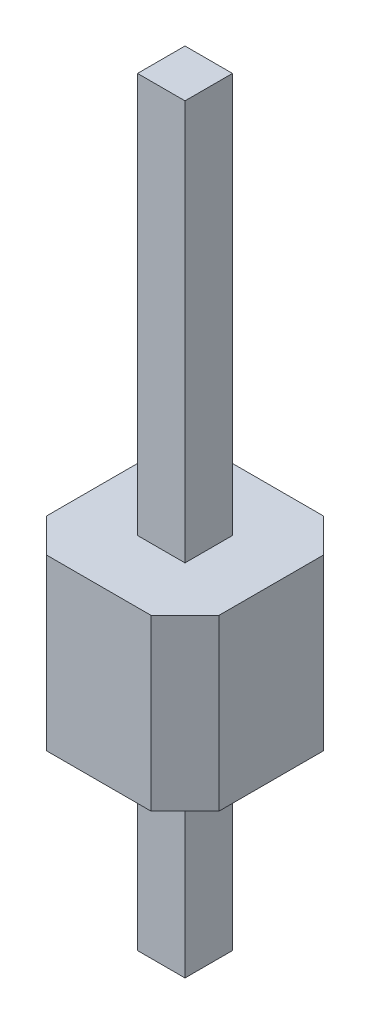
ISO-10303-21;
HEADER;
FILE_DESCRIPTION(('STEP AP214'),'2;1');
FILE_NAME('part.step','',(''),(''),'','','');
FILE_SCHEMA(('AUTOMOTIVE_DESIGN { 1 0 10303 214 1 1 1 1 }'));
ENDSEC;
DATA;
#1=APPLICATION_CONTEXT('core data for automotive mechanical design processes');
#2=APPLICATION_PROTOCOL_DEFINITION('international standard','automotive_design',2000,#1);
#3=PRODUCT_CONTEXT('',#1,'mechanical');
#4=PRODUCT('Part','Part','',(#3));
#5=PRODUCT_RELATED_PRODUCT_CATEGORY('part','',(#4));
#6=PRODUCT_DEFINITION_FORMATION('','',#4);
#7=PRODUCT_DEFINITION_CONTEXT('part definition',#1,'design');
#8=PRODUCT_DEFINITION('design','',#6,#7);
#9=PRODUCT_DEFINITION_SHAPE('','',#8);
#10=(LENGTH_UNIT() NAMED_UNIT(*) SI_UNIT(.MILLI.,.METRE.));
#11=(NAMED_UNIT(*) PLANE_ANGLE_UNIT() SI_UNIT($,.RADIAN.));
#12=(NAMED_UNIT(*) SI_UNIT($,.STERADIAN.) SOLID_ANGLE_UNIT());
#13=UNCERTAINTY_MEASURE_WITH_UNIT(LENGTH_MEASURE(1.E-05),#10,'distance_accuracy_value','');
#14=(GEOMETRIC_REPRESENTATION_CONTEXT(3) GLOBAL_UNCERTAINTY_ASSIGNED_CONTEXT((#13)) GLOBAL_UNIT_ASSIGNED_CONTEXT((#10,
#11,#12)) REPRESENTATION_CONTEXT('',''));
#15=CARTESIAN_POINT('',(0.,0.,0.));
#16=DIRECTION('',(0.,0.,1.));
#17=DIRECTION('',(1.,0.,0.));
#18=AXIS2_PLACEMENT_3D('',#15,#16,#17);
#19=CARTESIAN_POINT('',(1.62,11.2,0.));
#20=DIRECTION('',(1.,0.,0.));
#21=DIRECTION('',(0.,0.,-1.));
#22=AXIS2_PLACEMENT_3D('',#19,#20,#21);
#23=PLANE('',#22);
#24=DIRECTION('',(0.,0.,1.));
#25=VECTOR('',#24,1.);
#26=CARTESIAN_POINT('',(1.62,5.3,0.));
#27=LINE('',#26,#25);
#28=CARTESIAN_POINT('',(1.62,5.3,-1.62));
#29=VERTEX_POINT('',#28);
#30=CARTESIAN_POINT('',(1.62,5.3,-0.92));
#31=VERTEX_POINT('',#30);
#32=EDGE_CURVE('E160',#29,#31,#27,.T.);
#33=ORIENTED_EDGE('',*,*,#32,.F.);
#34=DIRECTION('',(0.,-1.,0.));
#35=VECTOR('',#34,1.);
#36=CARTESIAN_POINT('',(1.62,11.2,-1.62));
#37=LINE('',#36,#35);
#38=CARTESIAN_POINT('',(1.62,11.2,-1.62));
#39=VERTEX_POINT('',#38);
#40=EDGE_CURVE('E173',#39,#29,#37,.T.);
#41=ORIENTED_EDGE('',*,*,#40,.F.);
#42=DIRECTION('',(0.,0.,1.));
#43=VECTOR('',#42,1.);
#44=CARTESIAN_POINT('',(1.62,11.2,0.));
#45=LINE('',#44,#43);
#46=CARTESIAN_POINT('',(1.62,11.2,-0.92));
#47=VERTEX_POINT('',#46);
#48=EDGE_CURVE('E286',#39,#47,#45,.T.);
#49=ORIENTED_EDGE('',*,*,#48,.T.);
#50=DIRECTION('',(0.,-1.,0.));
#51=VECTOR('',#50,1.);
#52=CARTESIAN_POINT('',(1.62,11.2,-0.92));
#53=LINE('',#52,#51);
#54=EDGE_CURVE('E176',#47,#31,#53,.T.);
#55=ORIENTED_EDGE('',*,*,#54,.T.);
#56=EDGE_LOOP('',(#33,#41,#49,#55));
#57=FACE_BOUND('',#56,.T.);
#58=ADVANCED_FACE('F41',(#57),#23,.T.);
#59=CARTESIAN_POINT('',(0.,11.2,-1.62));
#60=DIRECTION('',(0.,0.,-1.));
#61=DIRECTION('',(-1.,0.,0.));
#62=AXIS2_PLACEMENT_3D('',#59,#60,#61);
#63=PLANE('',#62);
#64=DIRECTION('',(1.,0.,0.));
#65=VECTOR('',#64,1.);
#66=CARTESIAN_POINT('',(0.,5.3,-1.62));
#67=LINE('',#66,#65);
#68=CARTESIAN_POINT('',(0.919999999999999,5.3,-1.62));
#69=VERTEX_POINT('',#68);
#70=EDGE_CURVE('E157',#69,#29,#67,.T.);
#71=ORIENTED_EDGE('',*,*,#70,.F.);
#72=DIRECTION('',(0.,-1.,0.));
#73=VECTOR('',#72,1.);
#74=CARTESIAN_POINT('',(0.919999999999999,11.2,-1.62));
#75=LINE('',#74,#73);
#76=CARTESIAN_POINT('',(0.919999999999999,11.2,-1.62));
#77=VERTEX_POINT('',#76);
#78=EDGE_CURVE('E192',#77,#69,#75,.T.);
#79=ORIENTED_EDGE('',*,*,#78,.F.);
#80=DIRECTION('',(1.,0.,0.));
#81=VECTOR('',#80,1.);
#82=CARTESIAN_POINT('',(0.,11.2,-1.62));
#83=LINE('',#82,#81);
#84=EDGE_CURVE('E183',#77,#39,#83,.T.);
#85=ORIENTED_EDGE('',*,*,#84,.T.);
#86=ORIENTED_EDGE('',*,*,#40,.T.);
#87=EDGE_LOOP('',(#71,#79,#85,#86));
#88=FACE_BOUND('',#87,.T.);
#89=ADVANCED_FACE('F181',(#88),#63,.T.);
#90=CARTESIAN_POINT('',(0.92,11.2,0.));
#91=DIRECTION('',(1.,0.,0.));
#92=DIRECTION('',(0.,0.,-1.));
#93=AXIS2_PLACEMENT_3D('',#90,#91,#92);
#94=PLANE('',#93);
#95=ORIENTED_EDGE('',*,*,#78,.T.);
#96=DIRECTION('',(0.,0.,1.));
#97=VECTOR('',#96,1.);
#98=CARTESIAN_POINT('',(0.92,5.3,0.));
#99=LINE('',#98,#97);
#100=CARTESIAN_POINT('',(0.92,5.3,-0.92));
#101=VERTEX_POINT('',#100);
#102=EDGE_CURVE('E163',#69,#101,#99,.T.);
#103=ORIENTED_EDGE('',*,*,#102,.T.);
#104=DIRECTION('',(0.,-1.,0.));
#105=VECTOR('',#104,1.);
#106=CARTESIAN_POINT('',(0.92,11.2,-0.92));
#107=LINE('',#106,#105);
#108=CARTESIAN_POINT('',(0.92,11.2,-0.92));
#109=VERTEX_POINT('',#108);
#110=EDGE_CURVE('E316',#109,#101,#107,.T.);
#111=ORIENTED_EDGE('',*,*,#110,.F.);
#112=DIRECTION('',(0.,0.,1.));
#113=VECTOR('',#112,1.);
#114=CARTESIAN_POINT('',(0.92,11.2,0.));
#115=LINE('',#114,#113);
#116=EDGE_CURVE('E292',#77,#109,#115,.T.);
#117=ORIENTED_EDGE('',*,*,#116,.F.);
#118=EDGE_LOOP('',(#95,#103,#111,#117));
#119=FACE_BOUND('',#118,.T.);
#120=ADVANCED_FACE('F377',(#119),#94,.F.);
#121=CARTESIAN_POINT('',(0.,11.2,-0.92));
#122=DIRECTION('',(0.,0.,-1.));
#123=DIRECTION('',(-1.,0.,0.));
#124=AXIS2_PLACEMENT_3D('',#121,#122,#123);
#125=PLANE('',#124);
#126=ORIENTED_EDGE('',*,*,#110,.T.);
#127=DIRECTION('',(1.,0.,0.));
#128=VECTOR('',#127,1.);
#129=CARTESIAN_POINT('',(0.,5.3,-0.92));
#130=LINE('',#129,#128);
#131=EDGE_CURVE('E178',#101,#31,#130,.T.);
#132=ORIENTED_EDGE('',*,*,#131,.T.);
#133=ORIENTED_EDGE('',*,*,#54,.F.);
#134=DIRECTION('',(1.,0.,0.));
#135=VECTOR('',#134,1.);
#136=CARTESIAN_POINT('',(0.,11.2,-0.92));
#137=LINE('',#136,#135);
#138=EDGE_CURVE('E295',#109,#47,#137,.T.);
#139=ORIENTED_EDGE('',*,*,#138,.F.);
#140=EDGE_LOOP('',(#126,#132,#133,#139));
#141=FACE_BOUND('',#140,.T.);
#142=ADVANCED_FACE('F394',(#141),#125,.F.);
#143=CARTESIAN_POINT('',(0.,11.2,0.));
#144=DIRECTION('',(0.,1.,0.));
#145=DIRECTION('',(0.,0.,1.));
#146=AXIS2_PLACEMENT_3D('',#143,#144,#145);
#147=PLANE('',#146);
#148=ORIENTED_EDGE('',*,*,#48,.F.);
#149=ORIENTED_EDGE('',*,*,#84,.F.);
#150=ORIENTED_EDGE('',*,*,#116,.T.);
#151=ORIENTED_EDGE('',*,*,#138,.T.);
#152=EDGE_LOOP('',(#148,#149,#150,#151));
#153=FACE_BOUND('',#152,.T.);
#154=ADVANCED_FACE('F398',(#153),#147,.T.);
#155=CARTESIAN_POINT('',(0.,5.3,0.));
#156=DIRECTION('',(0.,0.,-1.));
#157=DIRECTION('',(-1.,0.,0.));
#158=AXIS2_PLACEMENT_3D('',#155,#156,#157);
#159=PLANE('',#158);
#160=DIRECTION('',(1.,0.,0.));
#161=VECTOR('',#160,1.);
#162=CARTESIAN_POINT('',(0.,5.3,0.));
#163=LINE('',#162,#161);
#164=CARTESIAN_POINT('',(0.499999999999999,5.3,0.));
#165=VERTEX_POINT('',#164);
#166=CARTESIAN_POINT('',(2.04,5.3,0.));
#167=VERTEX_POINT('',#166);
#168=EDGE_CURVE('E250',#165,#167,#163,.T.);
#169=ORIENTED_EDGE('',*,*,#168,.F.);
#170=DIRECTION('',(0.,-1.,0.));
#171=VECTOR('',#170,1.);
#172=CARTESIAN_POINT('',(0.499999999999999,2.8,0.));
#173=LINE('',#172,#171);
#174=CARTESIAN_POINT('',(0.499999999999999,2.8,0.));
#175=VERTEX_POINT('',#174);
#176=EDGE_CURVE('E190',#165,#175,#173,.T.);
#177=ORIENTED_EDGE('',*,*,#176,.T.);
#178=DIRECTION('',(1.,0.,0.));
#179=VECTOR('',#178,1.);
#180=CARTESIAN_POINT('',(0.,2.8,0.));
#181=LINE('',#180,#179);
#182=CARTESIAN_POINT('',(2.04,2.8,0.));
#183=VERTEX_POINT('',#182);
#184=EDGE_CURVE('E268',#175,#183,#181,.T.);
#185=ORIENTED_EDGE('',*,*,#184,.T.);
#186=DIRECTION('',(0.,1.,0.));
#187=VECTOR('',#186,1.);
#188=CARTESIAN_POINT('',(2.04,5.3,0.));
#189=LINE('',#188,#187);
#190=EDGE_CURVE('E185',#183,#167,#189,.T.);
#191=ORIENTED_EDGE('',*,*,#190,.T.);
#192=EDGE_LOOP('',(#169,#177,#185,#191));
#193=FACE_BOUND('',#192,.T.);
#194=ADVANCED_FACE('F358',(#193),#159,.F.);
#195=CARTESIAN_POINT('',(2.54,5.3,0.));
#196=DIRECTION('',(-1.,0.,0.));
#197=DIRECTION('',(0.,0.,1.));
#198=AXIS2_PLACEMENT_3D('',#195,#196,#197);
#199=PLANE('',#198);
#200=DIRECTION('',(0.,0.,-1.));
#201=VECTOR('',#200,1.);
#202=CARTESIAN_POINT('',(2.54,5.3,0.));
#203=LINE('',#202,#201);
#204=CARTESIAN_POINT('',(2.54,5.3,-0.499999999999999));
#205=VERTEX_POINT('',#204);
#206=CARTESIAN_POINT('',(2.54,5.3,-2.04));
#207=VERTEX_POINT('',#206);
#208=EDGE_CURVE('E240',#205,#207,#203,.T.);
#209=ORIENTED_EDGE('',*,*,#208,.F.);
#210=DIRECTION('',(0.,-1.,0.));
#211=VECTOR('',#210,1.);
#212=CARTESIAN_POINT('',(2.54,5.3,-0.499999999999999));
#213=LINE('',#212,#211);
#214=CARTESIAN_POINT('',(2.54,2.8,-0.499999999999999));
#215=VERTEX_POINT('',#214);
#216=EDGE_CURVE('E11',#205,#215,#213,.T.);
#217=ORIENTED_EDGE('',*,*,#216,.T.);
#218=DIRECTION('',(0.,0.,-1.));
#219=VECTOR('',#218,1.);
#220=CARTESIAN_POINT('',(2.54,2.8,0.));
#221=LINE('',#220,#219);
#222=CARTESIAN_POINT('',(2.54,2.8,-2.04));
#223=VERTEX_POINT('',#222);
#224=EDGE_CURVE('E243',#215,#223,#221,.T.);
#225=ORIENTED_EDGE('',*,*,#224,.T.);
#226=DIRECTION('',(0.,1.,0.));
#227=VECTOR('',#226,1.);
#228=CARTESIAN_POINT('',(2.54,5.3,-2.04));
#229=LINE('',#228,#227);
#230=EDGE_CURVE('E51',#223,#207,#229,.T.);
#231=ORIENTED_EDGE('',*,*,#230,.T.);
#232=EDGE_LOOP('',(#209,#217,#225,#231));
#233=FACE_BOUND('',#232,.T.);
#234=ADVANCED_FACE('F239',(#233),#199,.F.);
#235=CARTESIAN_POINT('',(0.,5.3,-2.54));
#236=DIRECTION('',(0.,0.,-1.));
#237=DIRECTION('',(-1.,0.,0.));
#238=AXIS2_PLACEMENT_3D('',#235,#236,#237);
#239=PLANE('',#238);
#240=DIRECTION('',(1.,0.,0.));
#241=VECTOR('',#240,1.);
#242=CARTESIAN_POINT('',(0.,2.8,-2.54));
#243=LINE('',#242,#241);
#244=CARTESIAN_POINT('',(0.5,2.8,-2.54));
#245=VERTEX_POINT('',#244);
#246=CARTESIAN_POINT('',(2.04,2.8,-2.54));
#247=VERTEX_POINT('',#246);
#248=EDGE_CURVE('E255',#245,#247,#243,.T.);
#249=ORIENTED_EDGE('',*,*,#248,.F.);
#250=DIRECTION('',(0.,1.,0.));
#251=VECTOR('',#250,1.);
#252=CARTESIAN_POINT('',(0.5,5.3,-2.54));
#253=LINE('',#252,#251);
#254=CARTESIAN_POINT('',(0.5,5.3,-2.54));
#255=VERTEX_POINT('',#254);
#256=EDGE_CURVE('E65',#245,#255,#253,.T.);
#257=ORIENTED_EDGE('',*,*,#256,.T.);
#258=DIRECTION('',(1.,0.,0.));
#259=VECTOR('',#258,1.);
#260=CARTESIAN_POINT('',(0.,5.3,-2.54));
#261=LINE('',#260,#259);
#262=CARTESIAN_POINT('',(2.04,5.3,-2.54));
#263=VERTEX_POINT('',#262);
#264=EDGE_CURVE('E249',#255,#263,#261,.T.);
#265=ORIENTED_EDGE('',*,*,#264,.T.);
#266=DIRECTION('',(0.,-1.,0.));
#267=VECTOR('',#266,1.);
#268=CARTESIAN_POINT('',(2.04,2.8,-2.54));
#269=LINE('',#268,#267);
#270=EDGE_CURVE('E229',#263,#247,#269,.T.);
#271=ORIENTED_EDGE('',*,*,#270,.T.);
#272=EDGE_LOOP('',(#249,#257,#265,#271));
#273=FACE_BOUND('',#272,.T.);
#274=ADVANCED_FACE('F254',(#273),#239,.T.);
#275=CARTESIAN_POINT('',(0.,5.3,0.));
#276=DIRECTION('',(-1.,0.,0.));
#277=DIRECTION('',(0.,0.,1.));
#278=AXIS2_PLACEMENT_3D('',#275,#276,#277);
#279=PLANE('',#278);
#280=DIRECTION('',(0.,0.,-1.));
#281=VECTOR('',#280,1.);
#282=CARTESIAN_POINT('',(0.,2.8,0.));
#283=LINE('',#282,#281);
#284=CARTESIAN_POINT('',(0.,2.8,-0.500000000000002));
#285=VERTEX_POINT('',#284);
#286=CARTESIAN_POINT('',(0.,2.8,-2.04));
#287=VERTEX_POINT('',#286);
#288=EDGE_CURVE('E262',#285,#287,#283,.T.);
#289=ORIENTED_EDGE('',*,*,#288,.F.);
#290=DIRECTION('',(0.,1.,0.));
#291=VECTOR('',#290,1.);
#292=CARTESIAN_POINT('',(0.,5.3,-0.500000000000002));
#293=LINE('',#292,#291);
#294=CARTESIAN_POINT('',(0.,5.3,-0.500000000000002));
#295=VERTEX_POINT('',#294);
#296=EDGE_CURVE('E215',#285,#295,#293,.T.);
#297=ORIENTED_EDGE('',*,*,#296,.T.);
#298=DIRECTION('',(0.,0.,-1.));
#299=VECTOR('',#298,1.);
#300=CARTESIAN_POINT('',(0.,5.3,0.));
#301=LINE('',#300,#299);
#302=CARTESIAN_POINT('',(0.,5.3,-2.04));
#303=VERTEX_POINT('',#302);
#304=EDGE_CURVE('E168',#295,#303,#301,.T.);
#305=ORIENTED_EDGE('',*,*,#304,.T.);
#306=DIRECTION('',(0.,-1.,0.));
#307=VECTOR('',#306,1.);
#308=CARTESIAN_POINT('',(0.,5.3,-2.04));
#309=LINE('',#308,#307);
#310=EDGE_CURVE('E211',#303,#287,#309,.T.);
#311=ORIENTED_EDGE('',*,*,#310,.T.);
#312=EDGE_LOOP('',(#289,#297,#305,#311));
#313=FACE_BOUND('',#312,.T.);
#314=ADVANCED_FACE('F410',(#313),#279,.T.);
#315=CARTESIAN_POINT('',(0.,5.3,0.));
#316=DIRECTION('',(0.,1.,0.));
#317=DIRECTION('',(0.,0.,1.));
#318=AXIS2_PLACEMENT_3D('',#315,#316,#317);
#319=PLANE('',#318);
#320=ORIENTED_EDGE('',*,*,#304,.F.);
#321=DIRECTION('',(0.707106781186545,0.,0.70710678118655));
#322=VECTOR('',#321,1.);
#323=CARTESIAN_POINT('',(0.250000000000001,5.3,-0.249999999999999));
#324=LINE('',#323,#322);
#325=EDGE_CURVE('E226',#295,#165,#324,.T.);
#326=ORIENTED_EDGE('',*,*,#325,.T.);
#327=ORIENTED_EDGE('',*,*,#168,.T.);
#328=DIRECTION('',(-0.70710678118655,0.,0.707106781186545));
#329=VECTOR('',#328,1.);
#330=CARTESIAN_POINT('',(1.01999999999999,5.3,1.02));
#331=LINE('',#330,#329);
#332=EDGE_CURVE('E220',#167,#205,#331,.F.);
#333=ORIENTED_EDGE('',*,*,#332,.T.);
#334=ORIENTED_EDGE('',*,*,#208,.T.);
#335=DIRECTION('',(-0.707106781186545,0.,-0.70710678118655));
#336=VECTOR('',#335,1.);
#337=CARTESIAN_POINT('',(2.29000000000001,5.3,-2.28999999999999));
#338=LINE('',#337,#336);
#339=EDGE_CURVE('E58',#207,#263,#338,.T.);
#340=ORIENTED_EDGE('',*,*,#339,.T.);
#341=ORIENTED_EDGE('',*,*,#264,.F.);
#342=DIRECTION('',(0.70710678118655,0.,-0.707106781186545));
#343=VECTOR('',#342,1.);
#344=CARTESIAN_POINT('',(-1.02,5.3,-1.02000000000001));
#345=LINE('',#344,#343);
#346=EDGE_CURVE('E223',#255,#303,#345,.F.);
#347=ORIENTED_EDGE('',*,*,#346,.T.);
#348=EDGE_LOOP('',(#320,#326,#327,#333,#334,#340,#341,#347));
#349=FACE_BOUND('',#348,.T.);
#350=ORIENTED_EDGE('',*,*,#70,.T.);
#351=ORIENTED_EDGE('',*,*,#32,.T.);
#352=ORIENTED_EDGE('',*,*,#131,.F.);
#353=ORIENTED_EDGE('',*,*,#102,.F.);
#354=EDGE_LOOP('',(#350,#351,#352,#353));
#355=FACE_BOUND('',#354,.T.);
#356=ADVANCED_FACE('F159',(#349,#355),#319,.T.);
#357=CARTESIAN_POINT('',(0.,2.8,0.));
#358=DIRECTION('',(0.,1.,0.));
#359=DIRECTION('',(0.,0.,1.));
#360=AXIS2_PLACEMENT_3D('',#357,#358,#359);
#361=PLANE('',#360);
#362=ORIENTED_EDGE('',*,*,#184,.F.);
#363=DIRECTION('',(-0.707106781186545,0.,-0.70710678118655));
#364=VECTOR('',#363,1.);
#365=CARTESIAN_POINT('',(0.499999999999999,2.8,0.));
#366=LINE('',#365,#364);
#367=EDGE_CURVE('E208',#175,#285,#366,.T.);
#368=ORIENTED_EDGE('',*,*,#367,.T.);
#369=ORIENTED_EDGE('',*,*,#288,.T.);
#370=DIRECTION('',(-0.70710678118655,0.,0.707106781186545));
#371=VECTOR('',#370,1.);
#372=CARTESIAN_POINT('',(0.,2.8,-2.04));
#373=LINE('',#372,#371);
#374=EDGE_CURVE('E205',#287,#245,#373,.F.);
#375=ORIENTED_EDGE('',*,*,#374,.T.);
#376=ORIENTED_EDGE('',*,*,#248,.T.);
#377=DIRECTION('',(0.707106781186545,0.,0.70710678118655));
#378=VECTOR('',#377,1.);
#379=CARTESIAN_POINT('',(2.04,2.8,-2.54));
#380=LINE('',#379,#378);
#381=EDGE_CURVE('E199',#247,#223,#380,.T.);
#382=ORIENTED_EDGE('',*,*,#381,.T.);
#383=ORIENTED_EDGE('',*,*,#224,.F.);
#384=DIRECTION('',(0.70710678118655,0.,-0.707106781186545));
#385=VECTOR('',#384,1.);
#386=CARTESIAN_POINT('',(2.54,2.8,-0.499999999999999));
#387=LINE('',#386,#385);
#388=EDGE_CURVE('E202',#215,#183,#387,.F.);
#389=ORIENTED_EDGE('',*,*,#388,.T.);
#390=EDGE_LOOP('',(#362,#368,#369,#375,#376,#382,#383,#389));
#391=FACE_BOUND('',#390,.T.);
#392=DIRECTION('',(1.,0.,0.));
#393=VECTOR('',#392,1.);
#394=CARTESIAN_POINT('',(0.,2.8,-1.62));
#395=LINE('',#394,#393);
#396=CARTESIAN_POINT('',(0.919999999999999,2.8,-1.62));
#397=VERTEX_POINT('',#396);
#398=CARTESIAN_POINT('',(1.62,2.8,-1.62));
#399=VERTEX_POINT('',#398);
#400=EDGE_CURVE('E266',#397,#399,#395,.T.);
#401=ORIENTED_EDGE('',*,*,#400,.F.);
#402=DIRECTION('',(0.,0.,1.));
#403=VECTOR('',#402,1.);
#404=CARTESIAN_POINT('',(0.92,2.8,0.));
#405=LINE('',#404,#403);
#406=CARTESIAN_POINT('',(0.92,2.8,-0.92));
#407=VERTEX_POINT('',#406);
#408=EDGE_CURVE('E282',#397,#407,#405,.T.);
#409=ORIENTED_EDGE('',*,*,#408,.T.);
#410=DIRECTION('',(1.,0.,0.));
#411=VECTOR('',#410,1.);
#412=CARTESIAN_POINT('',(0.,2.8,-0.92));
#413=LINE('',#412,#411);
#414=CARTESIAN_POINT('',(1.62,2.8,-0.92));
#415=VERTEX_POINT('',#414);
#416=EDGE_CURVE('E278',#407,#415,#413,.T.);
#417=ORIENTED_EDGE('',*,*,#416,.T.);
#418=DIRECTION('',(0.,0.,1.));
#419=VECTOR('',#418,1.);
#420=CARTESIAN_POINT('',(1.62,2.8,0.));
#421=LINE('',#420,#419);
#422=EDGE_CURVE('E274',#399,#415,#421,.T.);
#423=ORIENTED_EDGE('',*,*,#422,.F.);
#424=EDGE_LOOP('',(#401,#409,#417,#423));
#425=FACE_BOUND('',#424,.T.);
#426=ADVANCED_FACE('F258',(#391,#425),#361,.F.);
#427=CARTESIAN_POINT('',(0.,0.,0.));
#428=DIRECTION('',(0.,1.,0.));
#429=DIRECTION('',(0.,0.,1.));
#430=AXIS2_PLACEMENT_3D('',#427,#428,#429);
#431=PLANE('',#430);
#432=DIRECTION('',(0.,0.,1.));
#433=VECTOR('',#432,1.);
#434=CARTESIAN_POINT('',(1.62,0.,0.));
#435=LINE('',#434,#433);
#436=CARTESIAN_POINT('',(1.62,0.,-1.62));
#437=VERTEX_POINT('',#436);
#438=CARTESIAN_POINT('',(1.62,0.,-0.92));
#439=VERTEX_POINT('',#438);
#440=EDGE_CURVE('E299',#437,#439,#435,.T.);
#441=ORIENTED_EDGE('',*,*,#440,.T.);
#442=DIRECTION('',(1.,0.,0.));
#443=VECTOR('',#442,1.);
#444=CARTESIAN_POINT('',(0.,0.,-0.92));
#445=LINE('',#444,#443);
#446=CARTESIAN_POINT('',(0.92,0.,-0.92));
#447=VERTEX_POINT('',#446);
#448=EDGE_CURVE('E289',#447,#439,#445,.T.);
#449=ORIENTED_EDGE('',*,*,#448,.F.);
#450=DIRECTION('',(0.,0.,1.));
#451=VECTOR('',#450,1.);
#452=CARTESIAN_POINT('',(0.92,0.,0.));
#453=LINE('',#452,#451);
#454=CARTESIAN_POINT('',(0.919999999999999,0.,-1.62));
#455=VERTEX_POINT('',#454);
#456=EDGE_CURVE('E307',#455,#447,#453,.T.);
#457=ORIENTED_EDGE('',*,*,#456,.F.);
#458=DIRECTION('',(1.,0.,0.));
#459=VECTOR('',#458,1.);
#460=CARTESIAN_POINT('',(0.,0.,-1.62));
#461=LINE('',#460,#459);
#462=EDGE_CURVE('E303',#455,#437,#461,.T.);
#463=ORIENTED_EDGE('',*,*,#462,.T.);
#464=EDGE_LOOP('',(#441,#449,#457,#463));
#465=FACE_BOUND('',#464,.T.);
#466=ADVANCED_FACE('F335',(#465),#431,.F.);
#467=ORIENTED_EDGE('',*,*,#416,.F.);
#468=EDGE_CURVE('E315',#407,#447,#107,.T.);
#469=ORIENTED_EDGE('',*,*,#468,.T.);
#470=ORIENTED_EDGE('',*,*,#448,.T.);
#471=EDGE_CURVE('E298',#415,#439,#53,.T.);
#472=ORIENTED_EDGE('',*,*,#471,.F.);
#473=EDGE_LOOP('',(#467,#469,#470,#472));
#474=FACE_BOUND('',#473,.T.);
#475=ADVANCED_FACE('F327',(#474),#125,.F.);
#476=ORIENTED_EDGE('',*,*,#408,.F.);
#477=EDGE_CURVE('E319',#397,#455,#75,.T.);
#478=ORIENTED_EDGE('',*,*,#477,.T.);
#479=ORIENTED_EDGE('',*,*,#456,.T.);
#480=ORIENTED_EDGE('',*,*,#468,.F.);
#481=EDGE_LOOP('',(#476,#478,#479,#480));
#482=FACE_BOUND('',#481,.T.);
#483=ADVANCED_FACE('F331',(#482),#94,.F.);
#484=ORIENTED_EDGE('',*,*,#477,.F.);
#485=ORIENTED_EDGE('',*,*,#400,.T.);
#486=EDGE_CURVE('E186',#399,#437,#37,.T.);
#487=ORIENTED_EDGE('',*,*,#486,.T.);
#488=ORIENTED_EDGE('',*,*,#462,.F.);
#489=EDGE_LOOP('',(#484,#485,#487,#488));
#490=FACE_BOUND('',#489,.T.);
#491=ADVANCED_FACE('F379',(#490),#63,.T.);
#492=ORIENTED_EDGE('',*,*,#486,.F.);
#493=ORIENTED_EDGE('',*,*,#422,.T.);
#494=ORIENTED_EDGE('',*,*,#471,.T.);
#495=ORIENTED_EDGE('',*,*,#440,.F.);
#496=EDGE_LOOP('',(#492,#493,#494,#495));
#497=FACE_BOUND('',#496,.T.);
#498=ADVANCED_FACE('F339',(#497),#23,.T.);
#499=CARTESIAN_POINT('',(0.499999999999999,5.3,0.));
#500=DIRECTION('',(-0.70710678118655,0.,0.707106781186545));
#501=DIRECTION('',(0.,1.,0.));
#502=AXIS2_PLACEMENT_3D('',#499,#500,#501);
#503=PLANE('',#502);
#504=ORIENTED_EDGE('',*,*,#325,.F.);
#505=ORIENTED_EDGE('',*,*,#296,.F.);
#506=ORIENTED_EDGE('',*,*,#367,.F.);
#507=ORIENTED_EDGE('',*,*,#176,.F.);
#508=EDGE_LOOP('',(#504,#505,#506,#507));
#509=FACE_BOUND('',#508,.T.);
#510=ADVANCED_FACE('F368',(#509),#503,.T.);
#511=CARTESIAN_POINT('',(0.,5.3,-2.04));
#512=DIRECTION('',(0.707106781186545,0.,0.70710678118655));
#513=DIRECTION('',(0.,-1.,0.));
#514=AXIS2_PLACEMENT_3D('',#511,#512,#513);
#515=PLANE('',#514);
#516=ORIENTED_EDGE('',*,*,#346,.F.);
#517=ORIENTED_EDGE('',*,*,#256,.F.);
#518=ORIENTED_EDGE('',*,*,#374,.F.);
#519=ORIENTED_EDGE('',*,*,#310,.F.);
#520=EDGE_LOOP('',(#516,#517,#518,#519));
#521=FACE_BOUND('',#520,.T.);
#522=ADVANCED_FACE('F363',(#521),#515,.F.);
#523=CARTESIAN_POINT('',(2.54,5.3,-0.499999999999999));
#524=DIRECTION('',(-0.707106781186545,0.,-0.70710678118655));
#525=DIRECTION('',(0.,-1.,0.));
#526=AXIS2_PLACEMENT_3D('',#523,#524,#525);
#527=PLANE('',#526);
#528=ORIENTED_EDGE('',*,*,#332,.F.);
#529=ORIENTED_EDGE('',*,*,#190,.F.);
#530=ORIENTED_EDGE('',*,*,#388,.F.);
#531=ORIENTED_EDGE('',*,*,#216,.F.);
#532=EDGE_LOOP('',(#528,#529,#530,#531));
#533=FACE_BOUND('',#532,.T.);
#534=ADVANCED_FACE('F361',(#533),#527,.F.);
#535=CARTESIAN_POINT('',(2.04,5.3,-2.54));
#536=DIRECTION('',(0.70710678118655,0.,-0.707106781186545));
#537=DIRECTION('',(0.,1.,0.));
#538=AXIS2_PLACEMENT_3D('',#535,#536,#537);
#539=PLANE('',#538);
#540=ORIENTED_EDGE('',*,*,#339,.F.);
#541=ORIENTED_EDGE('',*,*,#230,.F.);
#542=ORIENTED_EDGE('',*,*,#381,.F.);
#543=ORIENTED_EDGE('',*,*,#270,.F.);
#544=EDGE_LOOP('',(#540,#541,#542,#543));
#545=FACE_BOUND('',#544,.T.);
#546=ADVANCED_FACE('F44',(#545),#539,.T.);
#547=CLOSED_SHELL('',(#58,#89,#120,#142,#154,#194,#234,#274,#314,#356,#426,#466,#475,#483,#491,
#498,#510,#522,#534,#546));
#548=MANIFOLD_SOLID_BREP('B2',#547);
#549=ADVANCED_BREP_SHAPE_REPRESENTATION('',(#18,#548),#14);
#550=SHAPE_DEFINITION_REPRESENTATION(#9,#549);
ENDSEC;
END-ISO-10303-21;
